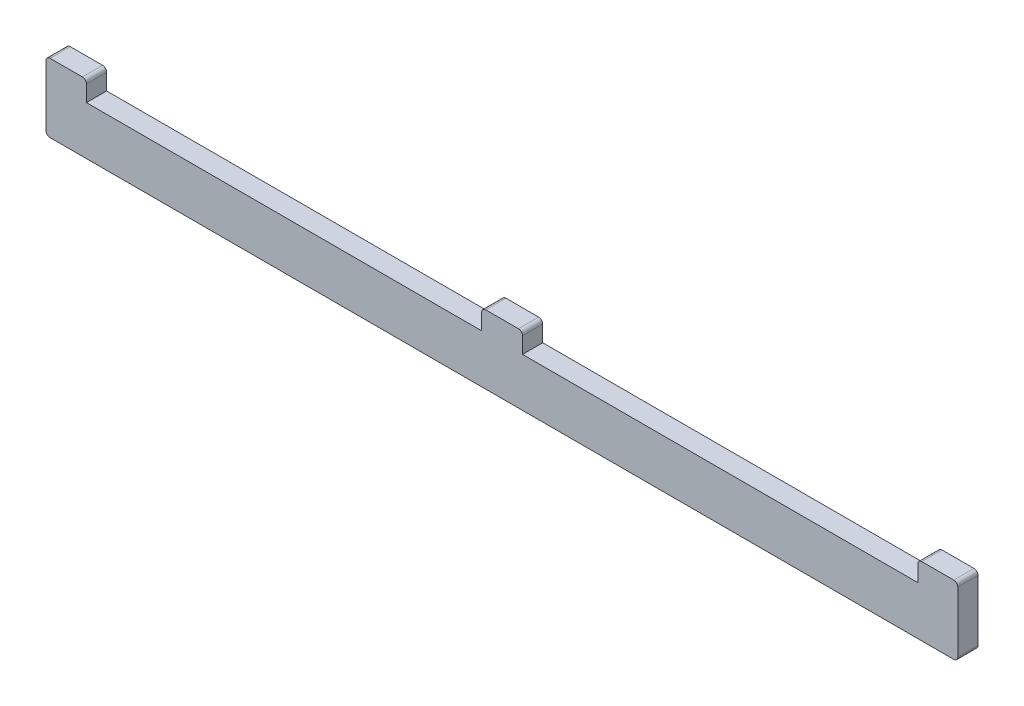
ISO-10303-21;
HEADER;
FILE_DESCRIPTION(('STEP AP214'),'2;1');
FILE_NAME('part.step','',(''),(''),'','','');
FILE_SCHEMA(('AUTOMOTIVE_DESIGN { 1 0 10303 214 1 1 1 1 }'));
ENDSEC;
DATA;
#1=APPLICATION_CONTEXT('core data for automotive mechanical design processes');
#2=APPLICATION_PROTOCOL_DEFINITION('international standard','automotive_design',2000,#1);
#3=PRODUCT_CONTEXT('',#1,'mechanical');
#4=PRODUCT('Part','Part','',(#3));
#5=PRODUCT_RELATED_PRODUCT_CATEGORY('part','',(#4));
#6=PRODUCT_DEFINITION_FORMATION('','',#4);
#7=PRODUCT_DEFINITION_CONTEXT('part definition',#1,'design');
#8=PRODUCT_DEFINITION('design','',#6,#7);
#9=PRODUCT_DEFINITION_SHAPE('','',#8);
#10=(LENGTH_UNIT() NAMED_UNIT(*) SI_UNIT(.MILLI.,.METRE.));
#11=(NAMED_UNIT(*) PLANE_ANGLE_UNIT() SI_UNIT($,.RADIAN.));
#12=(NAMED_UNIT(*) SI_UNIT($,.STERADIAN.) SOLID_ANGLE_UNIT());
#13=UNCERTAINTY_MEASURE_WITH_UNIT(LENGTH_MEASURE(1.E-05),#10,'distance_accuracy_value','');
#14=(GEOMETRIC_REPRESENTATION_CONTEXT(3) GLOBAL_UNCERTAINTY_ASSIGNED_CONTEXT((#13)) GLOBAL_UNIT_ASSIGNED_CONTEXT((#10,
#11,#12)) REPRESENTATION_CONTEXT('',''));
#15=CARTESIAN_POINT('',(0.,0.,0.));
#16=DIRECTION('',(0.,0.,1.));
#17=DIRECTION('',(1.,0.,0.));
#18=AXIS2_PLACEMENT_3D('',#15,#16,#17);
#19=CARTESIAN_POINT('',(107.8,12.,5.));
#20=DIRECTION('',(1.,0.,0.));
#21=DIRECTION('',(0.,1.,0.));
#22=AXIS2_PLACEMENT_3D('',#19,#20,#21);
#23=PLANE('',#22);
#24=DIRECTION('',(0.,-1.,0.));
#25=VECTOR('',#24,1.);
#26=CARTESIAN_POINT('',(107.8,12.,0.));
#27=LINE('',#26,#25);
#28=CARTESIAN_POINT('',(107.8,16.,0.));
#29=VERTEX_POINT('',#28);
#30=CARTESIAN_POINT('',(107.8,12.,0.));
#31=VERTEX_POINT('',#30);
#32=EDGE_CURVE('E209',#29,#31,#27,.T.);
#33=ORIENTED_EDGE('',*,*,#32,.T.);
#34=DIRECTION('',(0.,0.,-1.));
#35=VECTOR('',#34,1.);
#36=CARTESIAN_POINT('',(107.8,12.,5.));
#37=LINE('',#36,#35);
#38=CARTESIAN_POINT('',(107.8,12.,5.));
#39=VERTEX_POINT('',#38);
#40=EDGE_CURVE('E11',#39,#31,#37,.T.);
#41=ORIENTED_EDGE('',*,*,#40,.F.);
#42=DIRECTION('',(0.,-1.,0.));
#43=VECTOR('',#42,1.);
#44=CARTESIAN_POINT('',(107.8,12.,5.));
#45=LINE('',#44,#43);
#46=CARTESIAN_POINT('',(107.8,16.,5.));
#47=VERTEX_POINT('',#46);
#48=EDGE_CURVE('E247',#47,#39,#45,.T.);
#49=ORIENTED_EDGE('',*,*,#48,.F.);
#50=DIRECTION('',(0.,0.,-1.));
#51=VECTOR('',#50,1.);
#52=CARTESIAN_POINT('',(107.8,16.,5.));
#53=LINE('',#52,#51);
#54=EDGE_CURVE('E205',#47,#29,#53,.T.);
#55=ORIENTED_EDGE('',*,*,#54,.T.);
#56=EDGE_LOOP('',(#33,#41,#49,#55));
#57=FACE_BOUND('',#56,.T.);
#58=ADVANCED_FACE('F41',(#57),#23,.F.);
#59=CARTESIAN_POINT('',(10.,12.,5.));
#60=DIRECTION('',(0.,-1.,0.));
#61=DIRECTION('',(0.,0.,-1.));
#62=AXIS2_PLACEMENT_3D('',#59,#60,#61);
#63=PLANE('',#62);
#64=DIRECTION('',(-1.,0.,0.));
#65=VECTOR('',#64,1.);
#66=CARTESIAN_POINT('',(10.,12.,0.));
#67=LINE('',#66,#65);
#68=CARTESIAN_POINT('',(10.,12.,0.));
#69=VERTEX_POINT('',#68);
#70=EDGE_CURVE('E212',#31,#69,#67,.T.);
#71=ORIENTED_EDGE('',*,*,#70,.T.);
#72=DIRECTION('',(0.,0.,-1.));
#73=VECTOR('',#72,1.);
#74=CARTESIAN_POINT('',(10.,12.,5.));
#75=LINE('',#74,#73);
#76=CARTESIAN_POINT('',(10.,12.,5.));
#77=VERTEX_POINT('',#76);
#78=EDGE_CURVE('E49',#77,#69,#75,.T.);
#79=ORIENTED_EDGE('',*,*,#78,.F.);
#80=DIRECTION('',(-1.,0.,0.));
#81=VECTOR('',#80,1.);
#82=CARTESIAN_POINT('',(10.,12.,5.));
#83=LINE('',#82,#81);
#84=EDGE_CURVE('E136',#39,#77,#83,.T.);
#85=ORIENTED_EDGE('',*,*,#84,.F.);
#86=ORIENTED_EDGE('',*,*,#40,.T.);
#87=EDGE_LOOP('',(#71,#79,#85,#86));
#88=FACE_BOUND('',#87,.T.);
#89=ADVANCED_FACE('F365',(#88),#63,.F.);
#90=CARTESIAN_POINT('',(10.,12.,5.));
#91=DIRECTION('',(-1.,0.,0.));
#92=DIRECTION('',(0.,0.,1.));
#93=AXIS2_PLACEMENT_3D('',#90,#91,#92);
#94=PLANE('',#93);
#95=DIRECTION('',(0.,1.,0.));
#96=VECTOR('',#95,1.);
#97=CARTESIAN_POINT('',(10.,12.,0.));
#98=LINE('',#97,#96);
#99=CARTESIAN_POINT('',(10.,16.,0.));
#100=VERTEX_POINT('',#99);
#101=EDGE_CURVE('E214',#69,#100,#98,.T.);
#102=ORIENTED_EDGE('',*,*,#101,.T.);
#103=DIRECTION('',(0.,0.,-1.));
#104=VECTOR('',#103,1.);
#105=CARTESIAN_POINT('',(10.,16.,5.));
#106=LINE('',#105,#104);
#107=CARTESIAN_POINT('',(10.,16.,5.));
#108=VERTEX_POINT('',#107);
#109=EDGE_CURVE('E290',#108,#100,#106,.T.);
#110=ORIENTED_EDGE('',*,*,#109,.F.);
#111=DIRECTION('',(0.,1.,0.));
#112=VECTOR('',#111,1.);
#113=CARTESIAN_POINT('',(10.,12.,5.));
#114=LINE('',#113,#112);
#115=EDGE_CURVE('E298',#77,#108,#114,.T.);
#116=ORIENTED_EDGE('',*,*,#115,.F.);
#117=ORIENTED_EDGE('',*,*,#78,.T.);
#118=EDGE_LOOP('',(#102,#110,#116,#117));
#119=FACE_BOUND('',#118,.T.);
#120=ADVANCED_FACE('F296',(#119),#94,.F.);
#121=CARTESIAN_POINT('',(9.,16.,5.));
#122=DIRECTION('',(0.,0.,-1.));
#123=DIRECTION('',(-1.,0.,0.));
#124=AXIS2_PLACEMENT_3D('',#121,#122,#123);
#125=CYLINDRICAL_SURFACE('',#124,1.);
#126=CARTESIAN_POINT('',(9.,16.,0.));
#127=DIRECTION('',(0.,0.,1.));
#128=DIRECTION('',(1.,0.,0.));
#129=AXIS2_PLACEMENT_3D('',#126,#127,#128);
#130=CIRCLE('',#129,1.);
#131=CARTESIAN_POINT('',(9.,17.,0.));
#132=VERTEX_POINT('',#131);
#133=EDGE_CURVE('E216',#100,#132,#130,.T.);
#134=ORIENTED_EDGE('',*,*,#133,.T.);
#135=DIRECTION('',(0.,0.,-1.));
#136=VECTOR('',#135,1.);
#137=CARTESIAN_POINT('',(9.,17.,5.));
#138=LINE('',#137,#136);
#139=CARTESIAN_POINT('',(9.,17.,5.));
#140=VERTEX_POINT('',#139);
#141=EDGE_CURVE('E287',#140,#132,#138,.T.);
#142=ORIENTED_EDGE('',*,*,#141,.F.);
#143=CARTESIAN_POINT('',(9.,16.,5.));
#144=DIRECTION('',(0.,0.,1.));
#145=DIRECTION('',(1.,0.,0.));
#146=AXIS2_PLACEMENT_3D('',#143,#144,#145);
#147=CIRCLE('',#146,1.);
#148=EDGE_CURVE('E316',#108,#140,#147,.T.);
#149=ORIENTED_EDGE('',*,*,#148,.F.);
#150=ORIENTED_EDGE('',*,*,#109,.T.);
#151=EDGE_LOOP('',(#134,#142,#149,#150));
#152=FACE_BOUND('',#151,.T.);
#153=ADVANCED_FACE('F307',(#152),#125,.T.);
#154=CARTESIAN_POINT('',(1.,17.,5.));
#155=DIRECTION('',(0.,-1.,0.));
#156=DIRECTION('',(0.,0.,-1.));
#157=AXIS2_PLACEMENT_3D('',#154,#155,#156);
#158=PLANE('',#157);
#159=DIRECTION('',(-1.,0.,0.));
#160=VECTOR('',#159,1.);
#161=CARTESIAN_POINT('',(1.,17.,0.));
#162=LINE('',#161,#160);
#163=CARTESIAN_POINT('',(1.,17.,0.));
#164=VERTEX_POINT('',#163);
#165=EDGE_CURVE('E218',#132,#164,#162,.T.);
#166=ORIENTED_EDGE('',*,*,#165,.T.);
#167=DIRECTION('',(0.,0.,-1.));
#168=VECTOR('',#167,1.);
#169=CARTESIAN_POINT('',(1.,17.,5.));
#170=LINE('',#169,#168);
#171=CARTESIAN_POINT('',(1.,17.,5.));
#172=VERTEX_POINT('',#171);
#173=EDGE_CURVE('E284',#172,#164,#170,.T.);
#174=ORIENTED_EDGE('',*,*,#173,.F.);
#175=DIRECTION('',(-1.,0.,0.));
#176=VECTOR('',#175,1.);
#177=CARTESIAN_POINT('',(1.,17.,5.));
#178=LINE('',#177,#176);
#179=EDGE_CURVE('E313',#140,#172,#178,.T.);
#180=ORIENTED_EDGE('',*,*,#179,.F.);
#181=ORIENTED_EDGE('',*,*,#141,.T.);
#182=EDGE_LOOP('',(#166,#174,#180,#181));
#183=FACE_BOUND('',#182,.T.);
#184=ADVANCED_FACE('F311',(#183),#158,.F.);
#185=CARTESIAN_POINT('',(1.,16.,5.));
#186=DIRECTION('',(0.,0.,-1.));
#187=DIRECTION('',(-1.,0.,0.));
#188=AXIS2_PLACEMENT_3D('',#185,#186,#187);
#189=CYLINDRICAL_SURFACE('',#188,1.);
#190=CARTESIAN_POINT('',(1.,16.,0.));
#191=DIRECTION('',(0.,0.,1.));
#192=DIRECTION('',(1.,0.,0.));
#193=AXIS2_PLACEMENT_3D('',#190,#191,#192);
#194=CIRCLE('',#193,1.);
#195=CARTESIAN_POINT('',(0.,16.,0.));
#196=VERTEX_POINT('',#195);
#197=EDGE_CURVE('E220',#164,#196,#194,.T.);
#198=ORIENTED_EDGE('',*,*,#197,.T.);
#199=DIRECTION('',(0.,0.,-1.));
#200=VECTOR('',#199,1.);
#201=CARTESIAN_POINT('',(0.,16.,5.));
#202=LINE('',#201,#200);
#203=CARTESIAN_POINT('',(0.,16.,5.));
#204=VERTEX_POINT('',#203);
#205=EDGE_CURVE('E281',#204,#196,#202,.T.);
#206=ORIENTED_EDGE('',*,*,#205,.F.);
#207=CARTESIAN_POINT('',(1.,16.,5.));
#208=DIRECTION('',(0.,0.,1.));
#209=DIRECTION('',(1.,0.,0.));
#210=AXIS2_PLACEMENT_3D('',#207,#208,#209);
#211=CIRCLE('',#210,1.);
#212=EDGE_CURVE('E315',#172,#204,#211,.T.);
#213=ORIENTED_EDGE('',*,*,#212,.F.);
#214=ORIENTED_EDGE('',*,*,#173,.T.);
#215=EDGE_LOOP('',(#198,#206,#213,#214));
#216=FACE_BOUND('',#215,.T.);
#217=ADVANCED_FACE('F378',(#216),#189,.T.);
#218=CARTESIAN_POINT('',(0.,16.,5.));
#219=DIRECTION('',(1.,0.,0.));
#220=DIRECTION('',(0.,1.,0.));
#221=AXIS2_PLACEMENT_3D('',#218,#219,#220);
#222=PLANE('',#221);
#223=DIRECTION('',(0.,-1.,0.));
#224=VECTOR('',#223,1.);
#225=CARTESIAN_POINT('',(0.,16.,0.));
#226=LINE('',#225,#224);
#227=CARTESIAN_POINT('',(0.,1.00000000000001,0.));
#228=VERTEX_POINT('',#227);
#229=EDGE_CURVE('E222',#196,#228,#226,.T.);
#230=ORIENTED_EDGE('',*,*,#229,.T.);
#231=DIRECTION('',(0.,0.,-1.));
#232=VECTOR('',#231,1.);
#233=CARTESIAN_POINT('',(0.,1.00000000000001,5.));
#234=LINE('',#233,#232);
#235=CARTESIAN_POINT('',(0.,1.00000000000001,5.));
#236=VERTEX_POINT('',#235);
#237=EDGE_CURVE('E278',#236,#228,#234,.T.);
#238=ORIENTED_EDGE('',*,*,#237,.F.);
#239=DIRECTION('',(0.,-1.,0.));
#240=VECTOR('',#239,1.);
#241=CARTESIAN_POINT('',(0.,16.,5.));
#242=LINE('',#241,#240);
#243=EDGE_CURVE('E318',#204,#236,#242,.T.);
#244=ORIENTED_EDGE('',*,*,#243,.F.);
#245=ORIENTED_EDGE('',*,*,#205,.T.);
#246=EDGE_LOOP('',(#230,#238,#244,#245));
#247=FACE_BOUND('',#246,.T.);
#248=ADVANCED_FACE('F381',(#247),#222,.F.);
#249=CARTESIAN_POINT('',(1.,1.,5.));
#250=DIRECTION('',(0.,0.,-1.));
#251=DIRECTION('',(-1.,0.,0.));
#252=AXIS2_PLACEMENT_3D('',#249,#250,#251);
#253=CYLINDRICAL_SURFACE('',#252,1.);
#254=CARTESIAN_POINT('',(1.,1.,0.));
#255=DIRECTION('',(0.,0.,1.));
#256=DIRECTION('',(-1.,0.,0.));
#257=AXIS2_PLACEMENT_3D('',#254,#255,#256);
#258=CIRCLE('',#257,1.);
#259=CARTESIAN_POINT('',(1.00000000000001,0.,0.));
#260=VERTEX_POINT('',#259);
#261=EDGE_CURVE('E224',#228,#260,#258,.T.);
#262=ORIENTED_EDGE('',*,*,#261,.T.);
#263=DIRECTION('',(0.,0.,-1.));
#264=VECTOR('',#263,1.);
#265=CARTESIAN_POINT('',(1.00000000000001,0.,5.));
#266=LINE('',#265,#264);
#267=CARTESIAN_POINT('',(1.00000000000001,0.,5.));
#268=VERTEX_POINT('',#267);
#269=EDGE_CURVE('E275',#268,#260,#266,.T.);
#270=ORIENTED_EDGE('',*,*,#269,.F.);
#271=CARTESIAN_POINT('',(1.,1.,5.));
#272=DIRECTION('',(0.,0.,1.));
#273=DIRECTION('',(-1.,0.,0.));
#274=AXIS2_PLACEMENT_3D('',#271,#272,#273);
#275=CIRCLE('',#274,1.);
#276=EDGE_CURVE('E324',#236,#268,#275,.T.);
#277=ORIENTED_EDGE('',*,*,#276,.F.);
#278=ORIENTED_EDGE('',*,*,#237,.T.);
#279=EDGE_LOOP('',(#262,#270,#277,#278));
#280=FACE_BOUND('',#279,.T.);
#281=ADVANCED_FACE('F385',(#280),#253,.T.);
#282=CARTESIAN_POINT('',(1.00000000000001,0.,5.));
#283=DIRECTION('',(0.,1.,0.));
#284=DIRECTION('',(0.,0.,1.));
#285=AXIS2_PLACEMENT_3D('',#282,#283,#284);
#286=PLANE('',#285);
#287=DIRECTION('',(1.,0.,0.));
#288=VECTOR('',#287,1.);
#289=CARTESIAN_POINT('',(1.00000000000001,0.,0.));
#290=LINE('',#289,#288);
#291=CARTESIAN_POINT('',(224.6,0.,0.));
#292=VERTEX_POINT('',#291);
#293=EDGE_CURVE('E226',#260,#292,#290,.T.);
#294=ORIENTED_EDGE('',*,*,#293,.T.);
#295=DIRECTION('',(0.,0.,-1.));
#296=VECTOR('',#295,1.);
#297=CARTESIAN_POINT('',(224.6,0.,5.));
#298=LINE('',#297,#296);
#299=CARTESIAN_POINT('',(224.6,0.,5.));
#300=VERTEX_POINT('',#299);
#301=EDGE_CURVE('E272',#300,#292,#298,.T.);
#302=ORIENTED_EDGE('',*,*,#301,.F.);
#303=DIRECTION('',(1.,0.,0.));
#304=VECTOR('',#303,1.);
#305=CARTESIAN_POINT('',(1.00000000000001,0.,5.));
#306=LINE('',#305,#304);
#307=EDGE_CURVE('E326',#268,#300,#306,.T.);
#308=ORIENTED_EDGE('',*,*,#307,.F.);
#309=ORIENTED_EDGE('',*,*,#269,.T.);
#310=EDGE_LOOP('',(#294,#302,#308,#309));
#311=FACE_BOUND('',#310,.T.);
#312=ADVANCED_FACE('F389',(#311),#286,.F.);
#313=CARTESIAN_POINT('',(224.6,1.,5.));
#314=DIRECTION('',(0.,0.,-1.));
#315=DIRECTION('',(-1.,0.,0.));
#316=AXIS2_PLACEMENT_3D('',#313,#314,#315);
#317=CYLINDRICAL_SURFACE('',#316,0.999999999999987);
#318=CARTESIAN_POINT('',(224.6,1.,0.));
#319=DIRECTION('',(0.,0.,1.));
#320=DIRECTION('',(-1.,0.,0.));
#321=AXIS2_PLACEMENT_3D('',#318,#319,#320);
#322=CIRCLE('',#321,0.999999999999987);
#323=CARTESIAN_POINT('',(225.6,1.,0.));
#324=VERTEX_POINT('',#323);
#325=EDGE_CURVE('E228',#292,#324,#322,.T.);
#326=ORIENTED_EDGE('',*,*,#325,.T.);
#327=DIRECTION('',(0.,0.,-1.));
#328=VECTOR('',#327,1.);
#329=CARTESIAN_POINT('',(225.6,1.,5.));
#330=LINE('',#329,#328);
#331=CARTESIAN_POINT('',(225.6,1.,5.));
#332=VERTEX_POINT('',#331);
#333=EDGE_CURVE('E269',#332,#324,#330,.T.);
#334=ORIENTED_EDGE('',*,*,#333,.F.);
#335=CARTESIAN_POINT('',(224.6,1.,5.));
#336=DIRECTION('',(0.,0.,1.));
#337=DIRECTION('',(-1.,0.,0.));
#338=AXIS2_PLACEMENT_3D('',#335,#336,#337);
#339=CIRCLE('',#338,0.999999999999987);
#340=EDGE_CURVE('E328',#300,#332,#339,.T.);
#341=ORIENTED_EDGE('',*,*,#340,.F.);
#342=ORIENTED_EDGE('',*,*,#301,.T.);
#343=EDGE_LOOP('',(#326,#334,#341,#342));
#344=FACE_BOUND('',#343,.T.);
#345=ADVANCED_FACE('F393',(#344),#317,.T.);
#346=CARTESIAN_POINT('',(225.6,16.,5.));
#347=DIRECTION('',(-1.,0.,0.));
#348=DIRECTION('',(0.,0.,1.));
#349=AXIS2_PLACEMENT_3D('',#346,#347,#348);
#350=PLANE('',#349);
#351=DIRECTION('',(0.,1.,0.));
#352=VECTOR('',#351,1.);
#353=CARTESIAN_POINT('',(225.6,16.,0.));
#354=LINE('',#353,#352);
#355=CARTESIAN_POINT('',(225.6,16.,0.));
#356=VERTEX_POINT('',#355);
#357=EDGE_CURVE('E230',#324,#356,#354,.T.);
#358=ORIENTED_EDGE('',*,*,#357,.T.);
#359=DIRECTION('',(0.,0.,-1.));
#360=VECTOR('',#359,1.);
#361=CARTESIAN_POINT('',(225.6,16.,5.));
#362=LINE('',#361,#360);
#363=CARTESIAN_POINT('',(225.6,16.,5.));
#364=VERTEX_POINT('',#363);
#365=EDGE_CURVE('E266',#364,#356,#362,.T.);
#366=ORIENTED_EDGE('',*,*,#365,.F.);
#367=DIRECTION('',(0.,1.,0.));
#368=VECTOR('',#367,1.);
#369=CARTESIAN_POINT('',(225.6,16.,5.));
#370=LINE('',#369,#368);
#371=EDGE_CURVE('E330',#332,#364,#370,.T.);
#372=ORIENTED_EDGE('',*,*,#371,.F.);
#373=ORIENTED_EDGE('',*,*,#333,.T.);
#374=EDGE_LOOP('',(#358,#366,#372,#373));
#375=FACE_BOUND('',#374,.T.);
#376=ADVANCED_FACE('F397',(#375),#350,.F.);
#377=CARTESIAN_POINT('',(224.6,16.,5.));
#378=DIRECTION('',(0.,0.,-1.));
#379=DIRECTION('',(-1.,0.,0.));
#380=AXIS2_PLACEMENT_3D('',#377,#378,#379);
#381=CYLINDRICAL_SURFACE('',#380,0.999999999999987);
#382=CARTESIAN_POINT('',(224.6,16.,0.));
#383=DIRECTION('',(0.,0.,1.));
#384=DIRECTION('',(1.,0.,0.));
#385=AXIS2_PLACEMENT_3D('',#382,#383,#384);
#386=CIRCLE('',#385,0.999999999999987);
#387=CARTESIAN_POINT('',(224.6,17.,0.));
#388=VERTEX_POINT('',#387);
#389=EDGE_CURVE('E232',#356,#388,#386,.T.);
#390=ORIENTED_EDGE('',*,*,#389,.T.);
#391=DIRECTION('',(0.,0.,-1.));
#392=VECTOR('',#391,1.);
#393=CARTESIAN_POINT('',(224.6,17.,5.));
#394=LINE('',#393,#392);
#395=CARTESIAN_POINT('',(224.6,17.,5.));
#396=VERTEX_POINT('',#395);
#397=EDGE_CURVE('E263',#396,#388,#394,.T.);
#398=ORIENTED_EDGE('',*,*,#397,.F.);
#399=CARTESIAN_POINT('',(224.6,16.,5.));
#400=DIRECTION('',(0.,0.,1.));
#401=DIRECTION('',(1.,0.,0.));
#402=AXIS2_PLACEMENT_3D('',#399,#400,#401);
#403=CIRCLE('',#402,0.999999999999987);
#404=EDGE_CURVE('E332',#364,#396,#403,.T.);
#405=ORIENTED_EDGE('',*,*,#404,.F.);
#406=ORIENTED_EDGE('',*,*,#365,.T.);
#407=EDGE_LOOP('',(#390,#398,#405,#406));
#408=FACE_BOUND('',#407,.T.);
#409=ADVANCED_FACE('F401',(#408),#381,.T.);
#410=CARTESIAN_POINT('',(224.6,17.,5.));
#411=DIRECTION('',(0.,-1.,0.));
#412=DIRECTION('',(1.,0.,0.));
#413=AXIS2_PLACEMENT_3D('',#410,#411,#412);
#414=PLANE('',#413);
#415=DIRECTION('',(-1.,0.,0.));
#416=VECTOR('',#415,1.);
#417=CARTESIAN_POINT('',(224.6,17.,0.));
#418=LINE('',#417,#416);
#419=CARTESIAN_POINT('',(216.7,17.,0.));
#420=VERTEX_POINT('',#419);
#421=EDGE_CURVE('E234',#388,#420,#418,.T.);
#422=ORIENTED_EDGE('',*,*,#421,.T.);
#423=DIRECTION('',(0.,0.,-1.));
#424=VECTOR('',#423,1.);
#425=CARTESIAN_POINT('',(216.7,17.,5.));
#426=LINE('',#425,#424);
#427=CARTESIAN_POINT('',(216.7,17.,5.));
#428=VERTEX_POINT('',#427);
#429=EDGE_CURVE('E260',#428,#420,#426,.T.);
#430=ORIENTED_EDGE('',*,*,#429,.F.);
#431=DIRECTION('',(-1.,0.,0.));
#432=VECTOR('',#431,1.);
#433=CARTESIAN_POINT('',(224.6,17.,5.));
#434=LINE('',#433,#432);
#435=EDGE_CURVE('E334',#396,#428,#434,.T.);
#436=ORIENTED_EDGE('',*,*,#435,.F.);
#437=ORIENTED_EDGE('',*,*,#397,.T.);
#438=EDGE_LOOP('',(#422,#430,#436,#437));
#439=FACE_BOUND('',#438,.T.);
#440=ADVANCED_FACE('F405',(#439),#414,.F.);
#441=CARTESIAN_POINT('',(216.7,16.,5.));
#442=DIRECTION('',(0.,0.,-1.));
#443=DIRECTION('',(-1.,0.,0.));
#444=AXIS2_PLACEMENT_3D('',#441,#442,#443);
#445=CYLINDRICAL_SURFACE('',#444,0.999999999999989);
#446=CARTESIAN_POINT('',(216.7,16.,0.));
#447=DIRECTION('',(0.,0.,1.));
#448=DIRECTION('',(1.,0.,0.));
#449=AXIS2_PLACEMENT_3D('',#446,#447,#448);
#450=CIRCLE('',#449,0.999999999999989);
#451=CARTESIAN_POINT('',(215.7,16.,0.));
#452=VERTEX_POINT('',#451);
#453=EDGE_CURVE('E236',#420,#452,#450,.T.);
#454=ORIENTED_EDGE('',*,*,#453,.T.);
#455=DIRECTION('',(0.,0.,-1.));
#456=VECTOR('',#455,1.);
#457=CARTESIAN_POINT('',(215.7,16.,5.));
#458=LINE('',#457,#456);
#459=CARTESIAN_POINT('',(215.7,16.,5.));
#460=VERTEX_POINT('',#459);
#461=EDGE_CURVE('E257',#460,#452,#458,.T.);
#462=ORIENTED_EDGE('',*,*,#461,.F.);
#463=CARTESIAN_POINT('',(216.7,16.,5.));
#464=DIRECTION('',(0.,0.,1.));
#465=DIRECTION('',(1.,0.,0.));
#466=AXIS2_PLACEMENT_3D('',#463,#464,#465);
#467=CIRCLE('',#466,0.999999999999989);
#468=EDGE_CURVE('E336',#428,#460,#467,.T.);
#469=ORIENTED_EDGE('',*,*,#468,.F.);
#470=ORIENTED_EDGE('',*,*,#429,.T.);
#471=EDGE_LOOP('',(#454,#462,#469,#470));
#472=FACE_BOUND('',#471,.T.);
#473=ADVANCED_FACE('F409',(#472),#445,.T.);
#474=CARTESIAN_POINT('',(215.7,12.,5.));
#475=DIRECTION('',(1.,0.,0.));
#476=DIRECTION('',(0.,1.,0.));
#477=AXIS2_PLACEMENT_3D('',#474,#475,#476);
#478=PLANE('',#477);
#479=DIRECTION('',(0.,-1.,0.));
#480=VECTOR('',#479,1.);
#481=CARTESIAN_POINT('',(215.7,12.,0.));
#482=LINE('',#481,#480);
#483=CARTESIAN_POINT('',(215.7,12.,0.));
#484=VERTEX_POINT('',#483);
#485=EDGE_CURVE('E238',#452,#484,#482,.T.);
#486=ORIENTED_EDGE('',*,*,#485,.T.);
#487=DIRECTION('',(0.,0.,-1.));
#488=VECTOR('',#487,1.);
#489=CARTESIAN_POINT('',(215.7,12.,5.));
#490=LINE('',#489,#488);
#491=CARTESIAN_POINT('',(215.7,12.,5.));
#492=VERTEX_POINT('',#491);
#493=EDGE_CURVE('E254',#492,#484,#490,.T.);
#494=ORIENTED_EDGE('',*,*,#493,.F.);
#495=DIRECTION('',(0.,-1.,0.));
#496=VECTOR('',#495,1.);
#497=CARTESIAN_POINT('',(215.7,12.,5.));
#498=LINE('',#497,#496);
#499=EDGE_CURVE('E338',#460,#492,#498,.T.);
#500=ORIENTED_EDGE('',*,*,#499,.F.);
#501=ORIENTED_EDGE('',*,*,#461,.T.);
#502=EDGE_LOOP('',(#486,#494,#500,#501));
#503=FACE_BOUND('',#502,.T.);
#504=ADVANCED_FACE('F413',(#503),#478,.F.);
#505=CARTESIAN_POINT('',(117.9,12.,5.));
#506=DIRECTION('',(0.,-1.,0.));
#507=DIRECTION('',(0.,0.,-1.));
#508=AXIS2_PLACEMENT_3D('',#505,#506,#507);
#509=PLANE('',#508);
#510=DIRECTION('',(-1.,0.,0.));
#511=VECTOR('',#510,1.);
#512=CARTESIAN_POINT('',(117.9,12.,0.));
#513=LINE('',#512,#511);
#514=CARTESIAN_POINT('',(117.9,12.,0.));
#515=VERTEX_POINT('',#514);
#516=EDGE_CURVE('E240',#484,#515,#513,.T.);
#517=ORIENTED_EDGE('',*,*,#516,.T.);
#518=DIRECTION('',(0.,0.,-1.));
#519=VECTOR('',#518,1.);
#520=CARTESIAN_POINT('',(117.9,12.,5.));
#521=LINE('',#520,#519);
#522=CARTESIAN_POINT('',(117.9,12.,5.));
#523=VERTEX_POINT('',#522);
#524=EDGE_CURVE('E251',#523,#515,#521,.T.);
#525=ORIENTED_EDGE('',*,*,#524,.F.);
#526=DIRECTION('',(-1.,0.,0.));
#527=VECTOR('',#526,1.);
#528=CARTESIAN_POINT('',(117.9,12.,5.));
#529=LINE('',#528,#527);
#530=EDGE_CURVE('E340',#492,#523,#529,.T.);
#531=ORIENTED_EDGE('',*,*,#530,.F.);
#532=ORIENTED_EDGE('',*,*,#493,.T.);
#533=EDGE_LOOP('',(#517,#525,#531,#532));
#534=FACE_BOUND('',#533,.T.);
#535=ADVANCED_FACE('F346',(#534),#509,.F.);
#536=CARTESIAN_POINT('',(117.9,12.,5.));
#537=DIRECTION('',(-1.,0.,0.));
#538=DIRECTION('',(0.,-1.,0.));
#539=AXIS2_PLACEMENT_3D('',#536,#537,#538);
#540=PLANE('',#539);
#541=DIRECTION('',(0.,1.,0.));
#542=VECTOR('',#541,1.);
#543=CARTESIAN_POINT('',(117.9,12.,0.));
#544=LINE('',#543,#542);
#545=CARTESIAN_POINT('',(117.9,16.,0.));
#546=VERTEX_POINT('',#545);
#547=EDGE_CURVE('E242',#515,#546,#544,.T.);
#548=ORIENTED_EDGE('',*,*,#547,.T.);
#549=DIRECTION('',(0.,0.,-1.));
#550=VECTOR('',#549,1.);
#551=CARTESIAN_POINT('',(117.9,16.,5.));
#552=LINE('',#551,#550);
#553=CARTESIAN_POINT('',(117.9,16.,5.));
#554=VERTEX_POINT('',#553);
#555=EDGE_CURVE('E200',#554,#546,#552,.T.);
#556=ORIENTED_EDGE('',*,*,#555,.F.);
#557=DIRECTION('',(0.,1.,0.));
#558=VECTOR('',#557,1.);
#559=CARTESIAN_POINT('',(117.9,12.,5.));
#560=LINE('',#559,#558);
#561=EDGE_CURVE('E191',#523,#554,#560,.T.);
#562=ORIENTED_EDGE('',*,*,#561,.F.);
#563=ORIENTED_EDGE('',*,*,#524,.T.);
#564=EDGE_LOOP('',(#548,#556,#562,#563));
#565=FACE_BOUND('',#564,.T.);
#566=ADVANCED_FACE('F350',(#565),#540,.F.);
#567=CARTESIAN_POINT('',(116.9,16.,5.));
#568=DIRECTION('',(0.,0.,-1.));
#569=DIRECTION('',(-1.,0.,0.));
#570=AXIS2_PLACEMENT_3D('',#567,#568,#569);
#571=CYLINDRICAL_SURFACE('',#570,0.999999999999994);
#572=CARTESIAN_POINT('',(116.9,16.,0.));
#573=DIRECTION('',(0.,0.,1.));
#574=DIRECTION('',(1.,0.,0.));
#575=AXIS2_PLACEMENT_3D('',#572,#573,#574);
#576=CIRCLE('',#575,0.999999999999994);
#577=CARTESIAN_POINT('',(116.9,17.,0.));
#578=VERTEX_POINT('',#577);
#579=EDGE_CURVE('E199',#546,#578,#576,.T.);
#580=ORIENTED_EDGE('',*,*,#579,.T.);
#581=DIRECTION('',(0.,0.,-1.));
#582=VECTOR('',#581,1.);
#583=CARTESIAN_POINT('',(116.9,17.,5.));
#584=LINE('',#583,#582);
#585=CARTESIAN_POINT('',(116.9,17.,5.));
#586=VERTEX_POINT('',#585);
#587=EDGE_CURVE('E196',#586,#578,#584,.T.);
#588=ORIENTED_EDGE('',*,*,#587,.F.);
#589=CARTESIAN_POINT('',(116.9,16.,5.));
#590=DIRECTION('',(0.,0.,1.));
#591=DIRECTION('',(1.,0.,0.));
#592=AXIS2_PLACEMENT_3D('',#589,#590,#591);
#593=CIRCLE('',#592,0.999999999999994);
#594=EDGE_CURVE('E185',#554,#586,#593,.T.);
#595=ORIENTED_EDGE('',*,*,#594,.F.);
#596=ORIENTED_EDGE('',*,*,#555,.T.);
#597=EDGE_LOOP('',(#580,#588,#595,#596));
#598=FACE_BOUND('',#597,.T.);
#599=ADVANCED_FACE('F197',(#598),#571,.T.);
#600=CARTESIAN_POINT('',(108.8,17.,5.));
#601=DIRECTION('',(0.,-1.,0.));
#602=DIRECTION('',(0.,0.,-1.));
#603=AXIS2_PLACEMENT_3D('',#600,#601,#602);
#604=PLANE('',#603);
#605=DIRECTION('',(-1.,0.,0.));
#606=VECTOR('',#605,1.);
#607=CARTESIAN_POINT('',(108.8,17.,0.));
#608=LINE('',#607,#606);
#609=CARTESIAN_POINT('',(108.8,17.,0.));
#610=VERTEX_POINT('',#609);
#611=EDGE_CURVE('E122',#578,#610,#608,.T.);
#612=ORIENTED_EDGE('',*,*,#611,.T.);
#613=DIRECTION('',(0.,0.,-1.));
#614=VECTOR('',#613,1.);
#615=CARTESIAN_POINT('',(108.8,17.,5.));
#616=LINE('',#615,#614);
#617=CARTESIAN_POINT('',(108.8,17.,5.));
#618=VERTEX_POINT('',#617);
#619=EDGE_CURVE('E201',#618,#610,#616,.T.);
#620=ORIENTED_EDGE('',*,*,#619,.F.);
#621=DIRECTION('',(-1.,0.,0.));
#622=VECTOR('',#621,1.);
#623=CARTESIAN_POINT('',(108.8,17.,5.));
#624=LINE('',#623,#622);
#625=EDGE_CURVE('E189',#586,#618,#624,.T.);
#626=ORIENTED_EDGE('',*,*,#625,.F.);
#627=ORIENTED_EDGE('',*,*,#587,.T.);
#628=EDGE_LOOP('',(#612,#620,#626,#627));
#629=FACE_BOUND('',#628,.T.);
#630=ADVANCED_FACE('F203',(#629),#604,.F.);
#631=CARTESIAN_POINT('',(108.8,16.,5.));
#632=DIRECTION('',(0.,0.,-1.));
#633=DIRECTION('',(-1.,0.,0.));
#634=AXIS2_PLACEMENT_3D('',#631,#632,#633);
#635=CYLINDRICAL_SURFACE('',#634,0.999999999999994);
#636=CARTESIAN_POINT('',(108.8,16.,0.));
#637=DIRECTION('',(0.,0.,1.));
#638=DIRECTION('',(1.,0.,0.));
#639=AXIS2_PLACEMENT_3D('',#636,#637,#638);
#640=CIRCLE('',#639,0.999999999999994);
#641=EDGE_CURVE('E128',#610,#29,#640,.T.);
#642=ORIENTED_EDGE('',*,*,#641,.T.);
#643=ORIENTED_EDGE('',*,*,#54,.F.);
#644=CARTESIAN_POINT('',(108.8,16.,5.));
#645=DIRECTION('',(0.,0.,1.));
#646=DIRECTION('',(1.,0.,0.));
#647=AXIS2_PLACEMENT_3D('',#644,#645,#646);
#648=CIRCLE('',#647,0.999999999999994);
#649=EDGE_CURVE('E57',#618,#47,#648,.T.);
#650=ORIENTED_EDGE('',*,*,#649,.F.);
#651=ORIENTED_EDGE('',*,*,#619,.T.);
#652=EDGE_LOOP('',(#642,#643,#650,#651));
#653=FACE_BOUND('',#652,.T.);
#654=ADVANCED_FACE('F354',(#653),#635,.T.);
#655=CARTESIAN_POINT('',(108.8,16.,5.));
#656=DIRECTION('',(0.,0.,1.));
#657=DIRECTION('',(1.,0.,0.));
#658=AXIS2_PLACEMENT_3D('',#655,#656,#657);
#659=PLANE('',#658);
#660=ORIENTED_EDGE('',*,*,#48,.T.);
#661=ORIENTED_EDGE('',*,*,#84,.T.);
#662=ORIENTED_EDGE('',*,*,#115,.T.);
#663=ORIENTED_EDGE('',*,*,#148,.T.);
#664=ORIENTED_EDGE('',*,*,#179,.T.);
#665=ORIENTED_EDGE('',*,*,#212,.T.);
#666=ORIENTED_EDGE('',*,*,#243,.T.);
#667=ORIENTED_EDGE('',*,*,#276,.T.);
#668=ORIENTED_EDGE('',*,*,#307,.T.);
#669=ORIENTED_EDGE('',*,*,#340,.T.);
#670=ORIENTED_EDGE('',*,*,#371,.T.);
#671=ORIENTED_EDGE('',*,*,#404,.T.);
#672=ORIENTED_EDGE('',*,*,#435,.T.);
#673=ORIENTED_EDGE('',*,*,#468,.T.);
#674=ORIENTED_EDGE('',*,*,#499,.T.);
#675=ORIENTED_EDGE('',*,*,#530,.T.);
#676=ORIENTED_EDGE('',*,*,#561,.T.);
#677=ORIENTED_EDGE('',*,*,#594,.T.);
#678=ORIENTED_EDGE('',*,*,#625,.T.);
#679=ORIENTED_EDGE('',*,*,#649,.T.);
#680=EDGE_LOOP('',(#660,#661,#662,#663,#664,#665,#666,#667,#668,#669,#670,#671,#672,#673,#674,
#675,#676,#677,#678,#679));
#681=FACE_BOUND('',#680,.T.);
#682=ADVANCED_FACE('F187',(#681),#659,.T.);
#683=CARTESIAN_POINT('',(108.8,16.,0.));
#684=DIRECTION('',(0.,0.,1.));
#685=DIRECTION('',(1.,0.,0.));
#686=AXIS2_PLACEMENT_3D('',#683,#684,#685);
#687=PLANE('',#686);
#688=ORIENTED_EDGE('',*,*,#32,.F.);
#689=ORIENTED_EDGE('',*,*,#641,.F.);
#690=ORIENTED_EDGE('',*,*,#611,.F.);
#691=ORIENTED_EDGE('',*,*,#579,.F.);
#692=ORIENTED_EDGE('',*,*,#547,.F.);
#693=ORIENTED_EDGE('',*,*,#516,.F.);
#694=ORIENTED_EDGE('',*,*,#485,.F.);
#695=ORIENTED_EDGE('',*,*,#453,.F.);
#696=ORIENTED_EDGE('',*,*,#421,.F.);
#697=ORIENTED_EDGE('',*,*,#389,.F.);
#698=ORIENTED_EDGE('',*,*,#357,.F.);
#699=ORIENTED_EDGE('',*,*,#325,.F.);
#700=ORIENTED_EDGE('',*,*,#293,.F.);
#701=ORIENTED_EDGE('',*,*,#261,.F.);
#702=ORIENTED_EDGE('',*,*,#229,.F.);
#703=ORIENTED_EDGE('',*,*,#197,.F.);
#704=ORIENTED_EDGE('',*,*,#165,.F.);
#705=ORIENTED_EDGE('',*,*,#133,.F.);
#706=ORIENTED_EDGE('',*,*,#101,.F.);
#707=ORIENTED_EDGE('',*,*,#70,.F.);
#708=EDGE_LOOP('',(#688,#689,#690,#691,#692,#693,#694,#695,#696,#697,#698,#699,#700,#701,#702,
#703,#704,#705,#706,#707));
#709=FACE_BOUND('',#708,.T.);
#710=ADVANCED_FACE('F302',(#709),#687,.F.);
#711=CLOSED_SHELL('',(#58,#89,#120,#153,#184,#217,#248,#281,#312,#345,#376,#409,#440,#473,#504,
#535,#566,#599,#630,#654,#682,#710));
#712=MANIFOLD_SOLID_BREP('B2',#711);
#713=ADVANCED_BREP_SHAPE_REPRESENTATION('',(#18,#712),#14);
#714=SHAPE_DEFINITION_REPRESENTATION(#9,#713);
ENDSEC;
END-ISO-10303-21;
